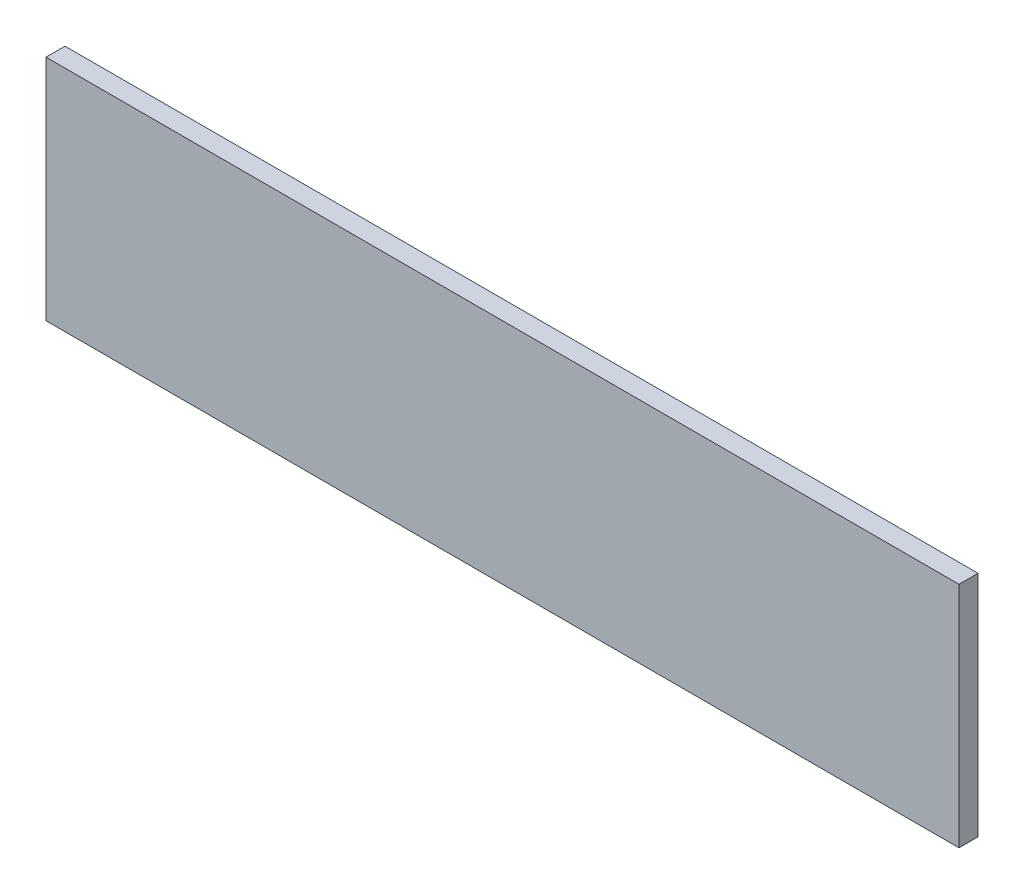
ISO-10303-21;
HEADER;
FILE_DESCRIPTION(('STEP AP214'),'2;1');
FILE_NAME('part.step','',(''),(''),'','','');
FILE_SCHEMA(('AUTOMOTIVE_DESIGN { 1 0 10303 214 1 1 1 1 }'));
ENDSEC;
DATA;
#1=APPLICATION_CONTEXT('core data for automotive mechanical design processes');
#2=APPLICATION_PROTOCOL_DEFINITION('international standard','automotive_design',2000,#1);
#3=PRODUCT_CONTEXT('',#1,'mechanical');
#4=PRODUCT('Part','Part','',(#3));
#5=PRODUCT_RELATED_PRODUCT_CATEGORY('part','',(#4));
#6=PRODUCT_DEFINITION_FORMATION('','',#4);
#7=PRODUCT_DEFINITION_CONTEXT('part definition',#1,'design');
#8=PRODUCT_DEFINITION('design','',#6,#7);
#9=PRODUCT_DEFINITION_SHAPE('','',#8);
#10=(LENGTH_UNIT() NAMED_UNIT(*) SI_UNIT(.MILLI.,.METRE.));
#11=(NAMED_UNIT(*) PLANE_ANGLE_UNIT() SI_UNIT($,.RADIAN.));
#12=(NAMED_UNIT(*) SI_UNIT($,.STERADIAN.) SOLID_ANGLE_UNIT());
#13=UNCERTAINTY_MEASURE_WITH_UNIT(LENGTH_MEASURE(1.E-05),#10,'distance_accuracy_value','');
#14=(GEOMETRIC_REPRESENTATION_CONTEXT(3) GLOBAL_UNCERTAINTY_ASSIGNED_CONTEXT((#13)) GLOBAL_UNIT_ASSIGNED_CONTEXT((#10,
#11,#12)) REPRESENTATION_CONTEXT('',''));
#15=CARTESIAN_POINT('',(0.,0.,0.));
#16=DIRECTION('',(0.,0.,1.));
#17=DIRECTION('',(1.,0.,0.));
#18=AXIS2_PLACEMENT_3D('',#15,#16,#17);
#19=CARTESIAN_POINT('',(304.8,-38.1,-3.175));
#20=DIRECTION('',(0.,0.,1.));
#21=DIRECTION('',(1.,0.,0.));
#22=AXIS2_PLACEMENT_3D('',#19,#20,#21);
#23=PLANE('',#22);
#24=DIRECTION('',(0.,1.,0.));
#25=VECTOR('',#24,1.);
#26=CARTESIAN_POINT('',(0.,-38.1,-3.175));
#27=LINE('',#26,#25);
#28=CARTESIAN_POINT('',(0.,-38.1,-3.175));
#29=VERTEX_POINT('',#28);
#30=CARTESIAN_POINT('',(0.,38.1,-3.175));
#31=VERTEX_POINT('',#30);
#32=EDGE_CURVE('E98',#29,#31,#27,.T.);
#33=ORIENTED_EDGE('',*,*,#32,.T.);
#34=DIRECTION('',(-1.,0.,0.));
#35=VECTOR('',#34,1.);
#36=CARTESIAN_POINT('',(304.8,38.1,-3.175));
#37=LINE('',#36,#35);
#38=CARTESIAN_POINT('',(304.8,38.1,-3.175));
#39=VERTEX_POINT('',#38);
#40=EDGE_CURVE('E11',#39,#31,#37,.T.);
#41=ORIENTED_EDGE('',*,*,#40,.F.);
#42=DIRECTION('',(0.,1.,0.));
#43=VECTOR('',#42,1.);
#44=CARTESIAN_POINT('',(304.8,-38.1,-3.175));
#45=LINE('',#44,#43);
#46=CARTESIAN_POINT('',(304.8,-38.1,-3.175));
#47=VERTEX_POINT('',#46);
#48=EDGE_CURVE('E86',#47,#39,#45,.T.);
#49=ORIENTED_EDGE('',*,*,#48,.F.);
#50=DIRECTION('',(-1.,0.,0.));
#51=VECTOR('',#50,1.);
#52=CARTESIAN_POINT('',(304.8,-38.1,-3.175));
#53=LINE('',#52,#51);
#54=EDGE_CURVE('E94',#47,#29,#53,.T.);
#55=ORIENTED_EDGE('',*,*,#54,.T.);
#56=EDGE_LOOP('',(#33,#41,#49,#55));
#57=FACE_BOUND('',#56,.T.);
#58=ADVANCED_FACE('F35',(#57),#23,.F.);
#59=CARTESIAN_POINT('',(304.8,38.1,3.175));
#60=DIRECTION('',(0.,-1.,0.));
#61=DIRECTION('',(0.,0.,-1.));
#62=AXIS2_PLACEMENT_3D('',#59,#60,#61);
#63=PLANE('',#62);
#64=DIRECTION('',(0.,0.,1.));
#65=VECTOR('',#64,1.);
#66=CARTESIAN_POINT('',(0.,38.1,3.175));
#67=LINE('',#66,#65);
#68=CARTESIAN_POINT('',(0.,38.1,3.175));
#69=VERTEX_POINT('',#68);
#70=EDGE_CURVE('E90',#31,#69,#67,.T.);
#71=ORIENTED_EDGE('',*,*,#70,.T.);
#72=DIRECTION('',(-1.,0.,0.));
#73=VECTOR('',#72,1.);
#74=CARTESIAN_POINT('',(304.8,38.1,3.175));
#75=LINE('',#74,#73);
#76=CARTESIAN_POINT('',(304.8,38.1,3.175));
#77=VERTEX_POINT('',#76);
#78=EDGE_CURVE('E43',#77,#69,#75,.T.);
#79=ORIENTED_EDGE('',*,*,#78,.F.);
#80=DIRECTION('',(0.,0.,1.));
#81=VECTOR('',#80,1.);
#82=CARTESIAN_POINT('',(304.8,38.1,3.175));
#83=LINE('',#82,#81);
#84=EDGE_CURVE('E81',#39,#77,#83,.T.);
#85=ORIENTED_EDGE('',*,*,#84,.F.);
#86=ORIENTED_EDGE('',*,*,#40,.T.);
#87=EDGE_LOOP('',(#71,#79,#85,#86));
#88=FACE_BOUND('',#87,.T.);
#89=ADVANCED_FACE('F89',(#88),#63,.F.);
#90=CARTESIAN_POINT('',(304.8,-38.1,3.175));
#91=DIRECTION('',(0.,0.,-1.));
#92=DIRECTION('',(-1.,0.,0.));
#93=AXIS2_PLACEMENT_3D('',#90,#91,#92);
#94=PLANE('',#93);
#95=DIRECTION('',(0.,-1.,0.));
#96=VECTOR('',#95,1.);
#97=CARTESIAN_POINT('',(0.,-38.1,3.175));
#98=LINE('',#97,#96);
#99=CARTESIAN_POINT('',(0.,-38.1,3.175));
#100=VERTEX_POINT('',#99);
#101=EDGE_CURVE('E68',#69,#100,#98,.T.);
#102=ORIENTED_EDGE('',*,*,#101,.T.);
#103=DIRECTION('',(-1.,0.,0.));
#104=VECTOR('',#103,1.);
#105=CARTESIAN_POINT('',(304.8,-38.1,3.175));
#106=LINE('',#105,#104);
#107=CARTESIAN_POINT('',(304.8,-38.1,3.175));
#108=VERTEX_POINT('',#107);
#109=EDGE_CURVE('E91',#108,#100,#106,.T.);
#110=ORIENTED_EDGE('',*,*,#109,.F.);
#111=DIRECTION('',(0.,-1.,0.));
#112=VECTOR('',#111,1.);
#113=CARTESIAN_POINT('',(304.8,-38.1,3.175));
#114=LINE('',#113,#112);
#115=EDGE_CURVE('E84',#77,#108,#114,.T.);
#116=ORIENTED_EDGE('',*,*,#115,.F.);
#117=ORIENTED_EDGE('',*,*,#78,.T.);
#118=EDGE_LOOP('',(#102,#110,#116,#117));
#119=FACE_BOUND('',#118,.T.);
#120=ADVANCED_FACE('F92',(#119),#94,.F.);
#121=CARTESIAN_POINT('',(304.8,-38.1,3.175));
#122=DIRECTION('',(0.,1.,0.));
#123=DIRECTION('',(0.,0.,1.));
#124=AXIS2_PLACEMENT_3D('',#121,#122,#123);
#125=PLANE('',#124);
#126=DIRECTION('',(0.,0.,-1.));
#127=VECTOR('',#126,1.);
#128=CARTESIAN_POINT('',(0.,-38.1,3.175));
#129=LINE('',#128,#127);
#130=EDGE_CURVE('E74',#100,#29,#129,.T.);
#131=ORIENTED_EDGE('',*,*,#130,.T.);
#132=ORIENTED_EDGE('',*,*,#54,.F.);
#133=DIRECTION('',(0.,0.,-1.));
#134=VECTOR('',#133,1.);
#135=CARTESIAN_POINT('',(304.8,-38.1,3.175));
#136=LINE('',#135,#134);
#137=EDGE_CURVE('E51',#108,#47,#136,.T.);
#138=ORIENTED_EDGE('',*,*,#137,.F.);
#139=ORIENTED_EDGE('',*,*,#109,.T.);
#140=EDGE_LOOP('',(#131,#132,#138,#139));
#141=FACE_BOUND('',#140,.T.);
#142=ADVANCED_FACE('F105',(#141),#125,.F.);
#143=CARTESIAN_POINT('',(304.8,0.,0.));
#144=DIRECTION('',(-1.,0.,0.));
#145=DIRECTION('',(0.,0.,1.));
#146=AXIS2_PLACEMENT_3D('',#143,#144,#145);
#147=PLANE('',#146);
#148=ORIENTED_EDGE('',*,*,#48,.T.);
#149=ORIENTED_EDGE('',*,*,#84,.T.);
#150=ORIENTED_EDGE('',*,*,#115,.T.);
#151=ORIENTED_EDGE('',*,*,#137,.T.);
#152=EDGE_LOOP('',(#148,#149,#150,#151));
#153=FACE_BOUND('',#152,.T.);
#154=ADVANCED_FACE('F82',(#153),#147,.F.);
#155=CARTESIAN_POINT('',(0.,0.,0.));
#156=DIRECTION('',(-1.,0.,0.));
#157=DIRECTION('',(0.,0.,1.));
#158=AXIS2_PLACEMENT_3D('',#155,#156,#157);
#159=PLANE('',#158);
#160=ORIENTED_EDGE('',*,*,#32,.F.);
#161=ORIENTED_EDGE('',*,*,#130,.F.);
#162=ORIENTED_EDGE('',*,*,#101,.F.);
#163=ORIENTED_EDGE('',*,*,#70,.F.);
#164=EDGE_LOOP('',(#160,#161,#162,#163));
#165=FACE_BOUND('',#164,.T.);
#166=ADVANCED_FACE('F108',(#165),#159,.T.);
#167=CLOSED_SHELL('',(#58,#89,#120,#142,#154,#166));
#168=MANIFOLD_SOLID_BREP('B2',#167);
#169=ADVANCED_BREP_SHAPE_REPRESENTATION('',(#18,#168),#14);
#170=SHAPE_DEFINITION_REPRESENTATION(#9,#169);
ENDSEC;
END-ISO-10303-21;
